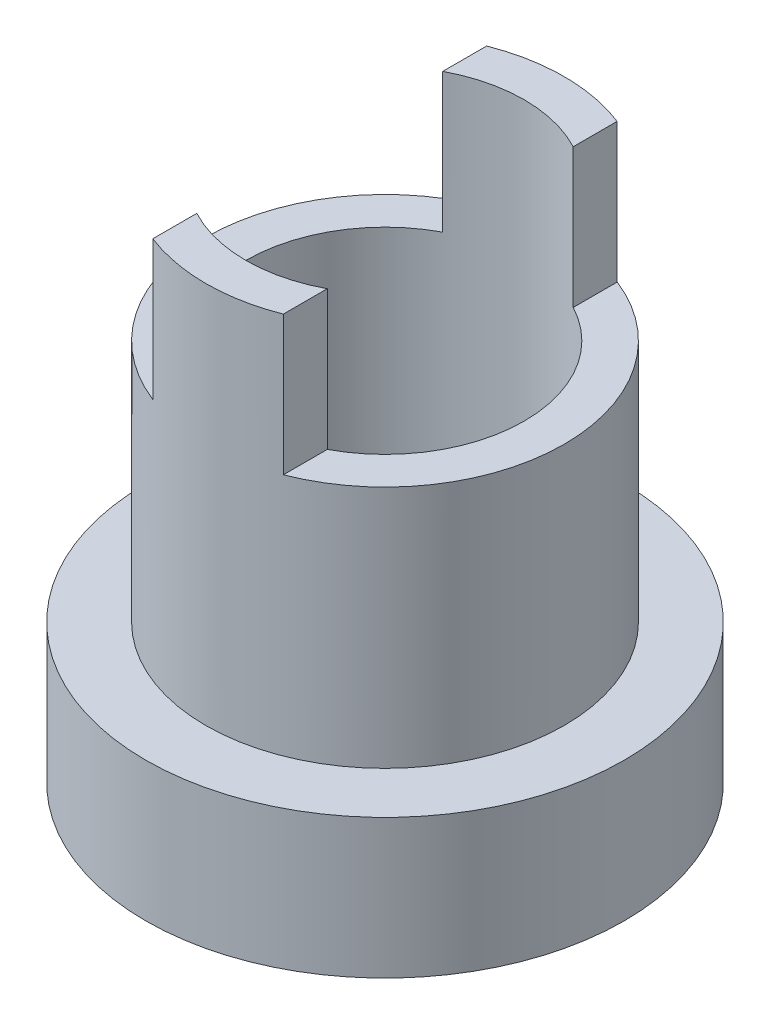
ISO-10303-21;
HEADER;
FILE_DESCRIPTION(('STEP AP214'),'2;1');
FILE_NAME('part.step','',(''),(''),'','','');
FILE_SCHEMA(('AUTOMOTIVE_DESIGN { 1 0 10303 214 1 1 1 1 }'));
ENDSEC;
DATA;
#1=APPLICATION_CONTEXT('core data for automotive mechanical design processes');
#2=APPLICATION_PROTOCOL_DEFINITION('international standard','automotive_design',2000,#1);
#3=PRODUCT_CONTEXT('',#1,'mechanical');
#4=PRODUCT('Part','Part','',(#3));
#5=PRODUCT_RELATED_PRODUCT_CATEGORY('part','',(#4));
#6=PRODUCT_DEFINITION_FORMATION('','',#4);
#7=PRODUCT_DEFINITION_CONTEXT('part definition',#1,'design');
#8=PRODUCT_DEFINITION('design','',#6,#7);
#9=PRODUCT_DEFINITION_SHAPE('','',#8);
#10=(LENGTH_UNIT() NAMED_UNIT(*) SI_UNIT(.MILLI.,.METRE.));
#11=(NAMED_UNIT(*) PLANE_ANGLE_UNIT() SI_UNIT($,.RADIAN.));
#12=(NAMED_UNIT(*) SI_UNIT($,.STERADIAN.) SOLID_ANGLE_UNIT());
#13=UNCERTAINTY_MEASURE_WITH_UNIT(LENGTH_MEASURE(1.E-05),#10,'distance_accuracy_value','');
#14=(GEOMETRIC_REPRESENTATION_CONTEXT(3) GLOBAL_UNCERTAINTY_ASSIGNED_CONTEXT((#13)) GLOBAL_UNIT_ASSIGNED_CONTEXT((#10,
#11,#12)) REPRESENTATION_CONTEXT('',''));
#15=CARTESIAN_POINT('',(0.,0.,0.));
#16=DIRECTION('',(0.,0.,1.));
#17=DIRECTION('',(1.,0.,0.));
#18=AXIS2_PLACEMENT_3D('',#15,#16,#17);
#19=CARTESIAN_POINT('',(0.,4.,0.));
#20=DIRECTION('',(0.,1.,0.));
#21=DIRECTION('',(0.,0.,1.));
#22=AXIS2_PLACEMENT_3D('',#19,#20,#21);
#23=PLANE('',#22);
#24=CARTESIAN_POINT('',(0.,4.,0.));
#25=DIRECTION('',(0.,1.,0.));
#26=DIRECTION('',(0.,0.,1.));
#27=AXIS2_PLACEMENT_3D('',#24,#25,#26);
#28=CIRCLE('',#27,5.15);
#29=CARTESIAN_POINT('',(0.,4.,5.15));
#30=VERTEX_POINT('',#29);
#31=EDGE_CURVE('E19',#30,#30,#28,.T.);
#32=ORIENTED_EDGE('',*,*,#31,.F.);
#33=EDGE_LOOP('',(#32));
#34=FACE_BOUND('',#33,.T.);
#35=CARTESIAN_POINT('',(0.,4.,0.));
#36=DIRECTION('',(0.,1.,0.));
#37=DIRECTION('',(0.,0.,1.));
#38=AXIS2_PLACEMENT_3D('',#35,#36,#37);
#39=CIRCLE('',#38,6.875);
#40=CARTESIAN_POINT('',(0.,4.,6.875));
#41=VERTEX_POINT('',#40);
#42=EDGE_CURVE('E107',#41,#41,#39,.F.);
#43=ORIENTED_EDGE('',*,*,#42,.F.);
#44=EDGE_LOOP('',(#43));
#45=FACE_BOUND('',#44,.T.);
#46=ADVANCED_FACE('F16',(#34,#45),#23,.T.);
#47=CARTESIAN_POINT('',(0.,4.,0.));
#48=DIRECTION('',(0.,1.,0.));
#49=DIRECTION('',(0.,0.,1.));
#50=AXIS2_PLACEMENT_3D('',#47,#48,#49);
#51=CYLINDRICAL_SURFACE('',#50,5.15);
#52=ORIENTED_EDGE('',*,*,#31,.T.);
#53=EDGE_LOOP('',(#52));
#54=FACE_BOUND('',#53,.T.);
#55=DIRECTION('',(0.,1.,0.));
#56=VECTOR('',#55,1.);
#57=CARTESIAN_POINT('',(1.875,13.,4.7965482380562));
#58=LINE('',#57,#56);
#59=CARTESIAN_POINT('',(1.875,15.,4.7965482380562));
#60=VERTEX_POINT('',#59);
#61=CARTESIAN_POINT('',(1.875,11.,4.7965482380562));
#62=VERTEX_POINT('',#61);
#63=EDGE_CURVE('E129',#60,#62,#58,.F.);
#64=ORIENTED_EDGE('',*,*,#63,.F.);
#65=CARTESIAN_POINT('',(0.,15.,0.));
#66=DIRECTION('',(0.,1.,0.));
#67=DIRECTION('',(0.,0.,1.));
#68=AXIS2_PLACEMENT_3D('',#65,#66,#67);
#69=CIRCLE('',#68,5.15);
#70=CARTESIAN_POINT('',(-1.875,15.,4.7965482380562));
#71=VERTEX_POINT('',#70);
#72=EDGE_CURVE('E116',#71,#60,#69,.T.);
#73=ORIENTED_EDGE('',*,*,#72,.F.);
#74=DIRECTION('',(0.,1.,0.));
#75=VECTOR('',#74,1.);
#76=CARTESIAN_POINT('',(-1.875,13.,4.7965482380562));
#77=LINE('',#76,#75);
#78=CARTESIAN_POINT('',(-1.875,11.,4.7965482380562));
#79=VERTEX_POINT('',#78);
#80=EDGE_CURVE('E110',#71,#79,#77,.F.);
#81=ORIENTED_EDGE('',*,*,#80,.T.);
#82=CARTESIAN_POINT('',(0.,11.,0.));
#83=DIRECTION('',(0.,1.,0.));
#84=DIRECTION('',(0.,0.,1.));
#85=AXIS2_PLACEMENT_3D('',#82,#83,#84);
#86=CIRCLE('',#85,5.15);
#87=CARTESIAN_POINT('',(-1.875,11.,-4.7965482380562));
#88=VERTEX_POINT('',#87);
#89=EDGE_CURVE('E97',#79,#88,#86,.F.);
#90=ORIENTED_EDGE('',*,*,#89,.T.);
#91=DIRECTION('',(0.,1.,0.));
#92=VECTOR('',#91,1.);
#93=CARTESIAN_POINT('',(-1.875,13.,-4.7965482380562));
#94=LINE('',#93,#92);
#95=CARTESIAN_POINT('',(-1.875,15.,-4.7965482380562));
#96=VERTEX_POINT('',#95);
#97=EDGE_CURVE('E139',#88,#96,#94,.T.);
#98=ORIENTED_EDGE('',*,*,#97,.T.);
#99=CARTESIAN_POINT('',(0.,15.,0.));
#100=DIRECTION('',(0.,1.,0.));
#101=DIRECTION('',(0.,0.,1.));
#102=AXIS2_PLACEMENT_3D('',#99,#100,#101);
#103=CIRCLE('',#102,5.15);
#104=CARTESIAN_POINT('',(1.875,15.,-4.7965482380562));
#105=VERTEX_POINT('',#104);
#106=EDGE_CURVE('E138',#105,#96,#103,.T.);
#107=ORIENTED_EDGE('',*,*,#106,.F.);
#108=DIRECTION('',(0.,1.,0.));
#109=VECTOR('',#108,1.);
#110=CARTESIAN_POINT('',(1.875,13.,-4.7965482380562));
#111=LINE('',#110,#109);
#112=CARTESIAN_POINT('',(1.875,11.,-4.7965482380562));
#113=VERTEX_POINT('',#112);
#114=EDGE_CURVE('E134',#113,#105,#111,.T.);
#115=ORIENTED_EDGE('',*,*,#114,.F.);
#116=CARTESIAN_POINT('',(0.,11.,0.));
#117=DIRECTION('',(0.,1.,0.));
#118=DIRECTION('',(0.,0.,1.));
#119=AXIS2_PLACEMENT_3D('',#116,#117,#118);
#120=CIRCLE('',#119,5.15);
#121=EDGE_CURVE('E133',#113,#62,#120,.F.);
#122=ORIENTED_EDGE('',*,*,#121,.T.);
#123=EDGE_LOOP('',(#64,#73,#81,#90,#98,#107,#115,#122));
#124=FACE_BOUND('',#123,.T.);
#125=ADVANCED_FACE('F115',(#54,#124),#51,.T.);
#126=CARTESIAN_POINT('',(0.,0.,0.));
#127=DIRECTION('',(0.,1.,0.));
#128=DIRECTION('',(0.,0.,1.));
#129=AXIS2_PLACEMENT_3D('',#126,#127,#128);
#130=CYLINDRICAL_SURFACE('',#129,6.875);
#131=CARTESIAN_POINT('',(0.,0.,0.));
#132=DIRECTION('',(0.,1.,0.));
#133=DIRECTION('',(0.,0.,1.));
#134=AXIS2_PLACEMENT_3D('',#131,#132,#133);
#135=CIRCLE('',#134,6.875);
#136=CARTESIAN_POINT('',(0.,0.,6.875));
#137=VERTEX_POINT('',#136);
#138=EDGE_CURVE('E118',#137,#137,#135,.T.);
#139=ORIENTED_EDGE('',*,*,#138,.T.);
#140=EDGE_LOOP('',(#139));
#141=FACE_BOUND('',#140,.T.);
#142=ORIENTED_EDGE('',*,*,#42,.T.);
#143=EDGE_LOOP('',(#142));
#144=FACE_BOUND('',#143,.T.);
#145=ADVANCED_FACE('F185',(#141,#144),#130,.T.);
#146=CARTESIAN_POINT('',(-1.875,11.,-6.23674060833547));
#147=DIRECTION('',(0.,-1.,0.));
#148=DIRECTION('',(0.,0.,-1.));
#149=AXIS2_PLACEMENT_3D('',#146,#147,#148);
#150=PLANE('',#149);
#151=DIRECTION('',(0.,0.,-1.));
#152=VECTOR('',#151,1.);
#153=CARTESIAN_POINT('',(-1.875,11.,-0.0726574679316326));
#154=LINE('',#153,#152);
#155=CARTESIAN_POINT('',(-1.875,11.,3.53332350627564));
#156=VERTEX_POINT('',#155);
#157=EDGE_CURVE('E101',#79,#156,#154,.T.);
#158=ORIENTED_EDGE('',*,*,#157,.T.);
#159=CARTESIAN_POINT('',(0.,11.,0.));
#160=DIRECTION('',(0.,1.,0.));
#161=DIRECTION('',(0.,0.,1.));
#162=AXIS2_PLACEMENT_3D('',#159,#160,#161);
#163=CIRCLE('',#162,4.);
#164=CARTESIAN_POINT('',(-1.875,11.,-3.53332350627564));
#165=VERTEX_POINT('',#164);
#166=EDGE_CURVE('E124',#156,#165,#163,.F.);
#167=ORIENTED_EDGE('',*,*,#166,.T.);
#168=DIRECTION('',(0.,0.,-1.));
#169=VECTOR('',#168,1.);
#170=CARTESIAN_POINT('',(-1.875,11.,-0.0726574679316326));
#171=LINE('',#170,#169);
#172=EDGE_CURVE('E102',#165,#88,#171,.T.);
#173=ORIENTED_EDGE('',*,*,#172,.T.);
#174=ORIENTED_EDGE('',*,*,#89,.F.);
#175=EDGE_LOOP('',(#158,#167,#173,#174));
#176=FACE_BOUND('',#175,.T.);
#177=ADVANCED_FACE('F99',(#176),#150,.F.);
#178=CARTESIAN_POINT('',(-1.875,13.,-0.0726574679316326));
#179=DIRECTION('',(1.,0.,0.));
#180=DIRECTION('',(0.,0.,-1.));
#181=AXIS2_PLACEMENT_3D('',#178,#179,#180);
#182=PLANE('',#181);
#183=ORIENTED_EDGE('',*,*,#172,.F.);
#184=DIRECTION('',(0.,1.,0.));
#185=VECTOR('',#184,1.);
#186=CARTESIAN_POINT('',(-1.875,0.,-3.53332350627564));
#187=LINE('',#186,#185);
#188=CARTESIAN_POINT('',(-1.875,15.,-3.53332350627564));
#189=VERTEX_POINT('',#188);
#190=EDGE_CURVE('E157',#165,#189,#187,.T.);
#191=ORIENTED_EDGE('',*,*,#190,.T.);
#192=DIRECTION('',(0.,0.,1.));
#193=VECTOR('',#192,1.);
#194=CARTESIAN_POINT('',(-1.875,15.,0.));
#195=LINE('',#194,#193);
#196=EDGE_CURVE('E141',#96,#189,#195,.T.);
#197=ORIENTED_EDGE('',*,*,#196,.F.);
#198=ORIENTED_EDGE('',*,*,#97,.F.);
#199=EDGE_LOOP('',(#183,#191,#197,#198));
#200=FACE_BOUND('',#199,.T.);
#201=ADVANCED_FACE('F220',(#200),#182,.F.);
#202=CARTESIAN_POINT('',(0.,15.,0.));
#203=DIRECTION('',(0.,1.,0.));
#204=DIRECTION('',(0.,0.,1.));
#205=AXIS2_PLACEMENT_3D('',#202,#203,#204);
#206=PLANE('',#205);
#207=DIRECTION('',(0.,0.,-1.));
#208=VECTOR('',#207,1.);
#209=CARTESIAN_POINT('',(1.875,15.,0.));
#210=LINE('',#209,#208);
#211=CARTESIAN_POINT('',(1.875,15.,-3.53332350627564));
#212=VERTEX_POINT('',#211);
#213=EDGE_CURVE('E137',#105,#212,#210,.F.);
#214=ORIENTED_EDGE('',*,*,#213,.F.);
#215=ORIENTED_EDGE('',*,*,#106,.T.);
#216=ORIENTED_EDGE('',*,*,#196,.T.);
#217=CARTESIAN_POINT('',(0.,15.,0.));
#218=DIRECTION('',(0.,1.,0.));
#219=DIRECTION('',(0.,0.,1.));
#220=AXIS2_PLACEMENT_3D('',#217,#218,#219);
#221=CIRCLE('',#220,4.);
#222=EDGE_CURVE('E153',#189,#212,#221,.F.);
#223=ORIENTED_EDGE('',*,*,#222,.T.);
#224=EDGE_LOOP('',(#214,#215,#216,#223));
#225=FACE_BOUND('',#224,.T.);
#226=ADVANCED_FACE('F216',(#225),#206,.T.);
#227=CARTESIAN_POINT('',(1.875,13.,0.));
#228=DIRECTION('',(1.,0.,0.));
#229=DIRECTION('',(0.,0.,-1.));
#230=AXIS2_PLACEMENT_3D('',#227,#228,#229);
#231=PLANE('',#230);
#232=DIRECTION('',(0.,1.,0.));
#233=VECTOR('',#232,1.);
#234=CARTESIAN_POINT('',(1.875,0.,-3.53332350627564));
#235=LINE('',#234,#233);
#236=CARTESIAN_POINT('',(1.875,11.,-3.53332350627564));
#237=VERTEX_POINT('',#236);
#238=EDGE_CURVE('E152',#212,#237,#235,.F.);
#239=ORIENTED_EDGE('',*,*,#238,.T.);
#240=DIRECTION('',(0.,0.,-1.));
#241=VECTOR('',#240,1.);
#242=CARTESIAN_POINT('',(1.875,11.,5.15));
#243=LINE('',#242,#241);
#244=EDGE_CURVE('E165',#237,#113,#243,.T.);
#245=ORIENTED_EDGE('',*,*,#244,.T.);
#246=ORIENTED_EDGE('',*,*,#114,.T.);
#247=ORIENTED_EDGE('',*,*,#213,.T.);
#248=EDGE_LOOP('',(#239,#245,#246,#247));
#249=FACE_BOUND('',#248,.T.);
#250=ADVANCED_FACE('F212',(#249),#231,.T.);
#251=CARTESIAN_POINT('',(1.875,11.,5.15));
#252=DIRECTION('',(0.,-1.,0.));
#253=DIRECTION('',(0.,0.,-1.));
#254=AXIS2_PLACEMENT_3D('',#251,#252,#253);
#255=PLANE('',#254);
#256=ORIENTED_EDGE('',*,*,#244,.F.);
#257=CARTESIAN_POINT('',(0.,11.,0.));
#258=DIRECTION('',(0.,1.,0.));
#259=DIRECTION('',(0.,0.,1.));
#260=AXIS2_PLACEMENT_3D('',#257,#258,#259);
#261=CIRCLE('',#260,4.);
#262=CARTESIAN_POINT('',(1.875,11.,3.53332350627564));
#263=VERTEX_POINT('',#262);
#264=EDGE_CURVE('E148',#237,#263,#261,.F.);
#265=ORIENTED_EDGE('',*,*,#264,.T.);
#266=DIRECTION('',(0.,0.,-1.));
#267=VECTOR('',#266,1.);
#268=CARTESIAN_POINT('',(1.875,11.,0.));
#269=LINE('',#268,#267);
#270=EDGE_CURVE('E132',#62,#263,#269,.T.);
#271=ORIENTED_EDGE('',*,*,#270,.F.);
#272=ORIENTED_EDGE('',*,*,#121,.F.);
#273=EDGE_LOOP('',(#256,#265,#271,#272));
#274=FACE_BOUND('',#273,.T.);
#275=ADVANCED_FACE('F208',(#274),#255,.F.);
#276=CARTESIAN_POINT('',(1.875,13.,0.));
#277=DIRECTION('',(1.,0.,0.));
#278=DIRECTION('',(0.,0.,-1.));
#279=AXIS2_PLACEMENT_3D('',#276,#277,#278);
#280=PLANE('',#279);
#281=DIRECTION('',(0.,1.,0.));
#282=VECTOR('',#281,1.);
#283=CARTESIAN_POINT('',(1.875,0.,3.53332350627564));
#284=LINE('',#283,#282);
#285=CARTESIAN_POINT('',(1.875,15.,3.53332350627564));
#286=VERTEX_POINT('',#285);
#287=EDGE_CURVE('E147',#263,#286,#284,.T.);
#288=ORIENTED_EDGE('',*,*,#287,.T.);
#289=DIRECTION('',(0.,0.,1.));
#290=VECTOR('',#289,1.);
#291=CARTESIAN_POINT('',(1.875,15.,0.));
#292=LINE('',#291,#290);
#293=EDGE_CURVE('E112',#60,#286,#292,.F.);
#294=ORIENTED_EDGE('',*,*,#293,.F.);
#295=ORIENTED_EDGE('',*,*,#63,.T.);
#296=ORIENTED_EDGE('',*,*,#270,.T.);
#297=EDGE_LOOP('',(#288,#294,#295,#296));
#298=FACE_BOUND('',#297,.T.);
#299=ADVANCED_FACE('F204',(#298),#280,.T.);
#300=CARTESIAN_POINT('',(0.,15.,0.));
#301=DIRECTION('',(0.,1.,0.));
#302=DIRECTION('',(0.,0.,1.));
#303=AXIS2_PLACEMENT_3D('',#300,#301,#302);
#304=PLANE('',#303);
#305=ORIENTED_EDGE('',*,*,#293,.T.);
#306=CARTESIAN_POINT('',(0.,15.,0.));
#307=DIRECTION('',(0.,1.,0.));
#308=DIRECTION('',(0.,0.,1.));
#309=AXIS2_PLACEMENT_3D('',#306,#307,#308);
#310=CIRCLE('',#309,4.);
#311=CARTESIAN_POINT('',(-1.875,15.,3.53332350627564));
#312=VERTEX_POINT('',#311);
#313=EDGE_CURVE('E143',#286,#312,#310,.F.);
#314=ORIENTED_EDGE('',*,*,#313,.T.);
#315=DIRECTION('',(0.,0.,-1.));
#316=VECTOR('',#315,1.);
#317=CARTESIAN_POINT('',(-1.875,15.,-0.0726574679316326));
#318=LINE('',#317,#316);
#319=EDGE_CURVE('E38',#312,#71,#318,.F.);
#320=ORIENTED_EDGE('',*,*,#319,.T.);
#321=ORIENTED_EDGE('',*,*,#72,.T.);
#322=EDGE_LOOP('',(#305,#314,#320,#321));
#323=FACE_BOUND('',#322,.T.);
#324=ADVANCED_FACE('F201',(#323),#304,.T.);
#325=CARTESIAN_POINT('',(-1.875,13.,-0.0726574679316326));
#326=DIRECTION('',(1.,0.,0.));
#327=DIRECTION('',(0.,0.,-1.));
#328=AXIS2_PLACEMENT_3D('',#325,#326,#327);
#329=PLANE('',#328);
#330=ORIENTED_EDGE('',*,*,#319,.F.);
#331=DIRECTION('',(0.,1.,0.));
#332=VECTOR('',#331,1.);
#333=CARTESIAN_POINT('',(-1.875,0.,3.53332350627564));
#334=LINE('',#333,#332);
#335=EDGE_CURVE('E26',#312,#156,#334,.F.);
#336=ORIENTED_EDGE('',*,*,#335,.T.);
#337=ORIENTED_EDGE('',*,*,#157,.F.);
#338=ORIENTED_EDGE('',*,*,#80,.F.);
#339=EDGE_LOOP('',(#330,#336,#337,#338));
#340=FACE_BOUND('',#339,.T.);
#341=ADVANCED_FACE('F109',(#340),#329,.F.);
#342=CARTESIAN_POINT('',(0.,0.,0.));
#343=DIRECTION('',(0.,1.,0.));
#344=DIRECTION('',(0.,0.,1.));
#345=AXIS2_PLACEMENT_3D('',#342,#343,#344);
#346=PLANE('',#345);
#347=CARTESIAN_POINT('',(0.,0.,0.));
#348=DIRECTION('',(0.,1.,0.));
#349=DIRECTION('',(0.,0.,1.));
#350=AXIS2_PLACEMENT_3D('',#347,#348,#349);
#351=CIRCLE('',#350,4.);
#352=CARTESIAN_POINT('',(0.,0.,4.));
#353=VERTEX_POINT('',#352);
#354=EDGE_CURVE('E11',#353,#353,#351,.T.);
#355=ORIENTED_EDGE('',*,*,#354,.T.);
#356=EDGE_LOOP('',(#355));
#357=FACE_BOUND('',#356,.T.);
#358=ORIENTED_EDGE('',*,*,#138,.F.);
#359=EDGE_LOOP('',(#358));
#360=FACE_BOUND('',#359,.T.);
#361=ADVANCED_FACE('F188',(#357,#360),#346,.F.);
#362=CARTESIAN_POINT('',(0.,0.,0.));
#363=DIRECTION('',(0.,1.,0.));
#364=DIRECTION('',(0.,0.,1.));
#365=AXIS2_PLACEMENT_3D('',#362,#363,#364);
#366=CYLINDRICAL_SURFACE('',#365,4.);
#367=ORIENTED_EDGE('',*,*,#354,.F.);
#368=EDGE_LOOP('',(#367));
#369=FACE_BOUND('',#368,.T.);
#370=ORIENTED_EDGE('',*,*,#313,.F.);
#371=ORIENTED_EDGE('',*,*,#287,.F.);
#372=ORIENTED_EDGE('',*,*,#264,.F.);
#373=ORIENTED_EDGE('',*,*,#238,.F.);
#374=ORIENTED_EDGE('',*,*,#222,.F.);
#375=ORIENTED_EDGE('',*,*,#190,.F.);
#376=ORIENTED_EDGE('',*,*,#166,.F.);
#377=ORIENTED_EDGE('',*,*,#335,.F.);
#378=EDGE_LOOP('',(#370,#371,#372,#373,#374,#375,#376,#377));
#379=FACE_BOUND('',#378,.T.);
#380=ADVANCED_FACE('F186',(#369,#379),#366,.F.);
#381=CLOSED_SHELL('',(#46,#125,#145,#177,#201,#226,#250,#275,#299,#324,#341,#361,#380));
#382=MANIFOLD_SOLID_BREP('B1',#381);
#383=ADVANCED_BREP_SHAPE_REPRESENTATION('',(#18,#382),#14);
#384=SHAPE_DEFINITION_REPRESENTATION(#9,#383);
ENDSEC;
END-ISO-10303-21;
